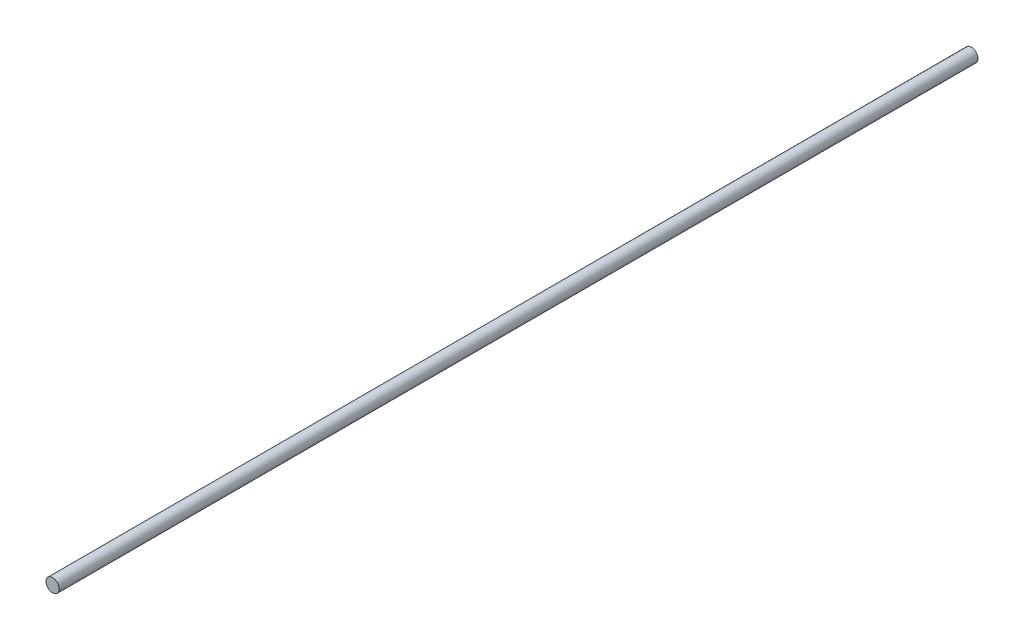
ISO-10303-21;
HEADER;
FILE_DESCRIPTION(('STEP AP214'),'2;1');
FILE_NAME('part.step','',(''),(''),'','','');
FILE_SCHEMA(('AUTOMOTIVE_DESIGN { 1 0 10303 214 1 1 1 1 }'));
ENDSEC;
DATA;
#1=APPLICATION_CONTEXT('core data for automotive mechanical design processes');
#2=APPLICATION_PROTOCOL_DEFINITION('international standard','automotive_design',2000,#1);
#3=PRODUCT_CONTEXT('',#1,'mechanical');
#4=PRODUCT('Part','Part','',(#3));
#5=PRODUCT_RELATED_PRODUCT_CATEGORY('part','',(#4));
#6=PRODUCT_DEFINITION_FORMATION('','',#4);
#7=PRODUCT_DEFINITION_CONTEXT('part definition',#1,'design');
#8=PRODUCT_DEFINITION('design','',#6,#7);
#9=PRODUCT_DEFINITION_SHAPE('','',#8);
#10=(LENGTH_UNIT() NAMED_UNIT(*) SI_UNIT(.MILLI.,.METRE.));
#11=(NAMED_UNIT(*) PLANE_ANGLE_UNIT() SI_UNIT($,.RADIAN.));
#12=(NAMED_UNIT(*) SI_UNIT($,.STERADIAN.) SOLID_ANGLE_UNIT());
#13=UNCERTAINTY_MEASURE_WITH_UNIT(LENGTH_MEASURE(1.E-05),#10,'distance_accuracy_value','');
#14=(GEOMETRIC_REPRESENTATION_CONTEXT(3) GLOBAL_UNCERTAINTY_ASSIGNED_CONTEXT((#13)) GLOBAL_UNIT_ASSIGNED_CONTEXT((#10,
#11,#12)) REPRESENTATION_CONTEXT('',''));
#15=CARTESIAN_POINT('',(0.,0.,0.));
#16=DIRECTION('',(0.,0.,1.));
#17=DIRECTION('',(1.,0.,0.));
#18=AXIS2_PLACEMENT_3D('',#15,#16,#17);
#19=CARTESIAN_POINT('',(0.,0.,-555.));
#20=DIRECTION('',(0.,0.,1.));
#21=DIRECTION('',(1.,0.,0.));
#22=AXIS2_PLACEMENT_3D('',#19,#20,#21);
#23=CYLINDRICAL_SURFACE('',#22,4.);
#24=CARTESIAN_POINT('',(0.,0.,-555.));
#25=DIRECTION('',(0.,0.,1.));
#26=DIRECTION('',(1.,0.,0.));
#27=AXIS2_PLACEMENT_3D('',#24,#25,#26);
#28=CIRCLE('',#27,4.);
#29=CARTESIAN_POINT('',(4.,0.,-555.));
#30=VERTEX_POINT('',#29);
#31=EDGE_CURVE('E10',#30,#30,#28,.T.);
#32=ORIENTED_EDGE('',*,*,#31,.T.);
#33=EDGE_LOOP('',(#32));
#34=FACE_BOUND('',#33,.T.);
#35=CARTESIAN_POINT('',(0.,0.,0.));
#36=DIRECTION('',(0.,0.,1.));
#37=DIRECTION('',(1.,0.,0.));
#38=AXIS2_PLACEMENT_3D('',#35,#36,#37);
#39=CIRCLE('',#38,4.);
#40=CARTESIAN_POINT('',(4.,0.,0.));
#41=VERTEX_POINT('',#40);
#42=EDGE_CURVE('E44',#41,#41,#39,.T.);
#43=ORIENTED_EDGE('',*,*,#42,.F.);
#44=EDGE_LOOP('',(#43));
#45=FACE_BOUND('',#44,.T.);
#46=ADVANCED_FACE('F41',(#34,#45),#23,.T.);
#47=CARTESIAN_POINT('',(0.,0.,-555.));
#48=DIRECTION('',(0.,0.,1.));
#49=DIRECTION('',(1.,0.,0.));
#50=AXIS2_PLACEMENT_3D('',#47,#48,#49);
#51=PLANE('',#50);
#52=ORIENTED_EDGE('',*,*,#31,.F.);
#53=EDGE_LOOP('',(#52));
#54=FACE_BOUND('',#53,.T.);
#55=ADVANCED_FACE('F56',(#54),#51,.F.);
#56=CARTESIAN_POINT('',(0.,0.,0.));
#57=DIRECTION('',(0.,0.,1.));
#58=DIRECTION('',(1.,0.,0.));
#59=AXIS2_PLACEMENT_3D('',#56,#57,#58);
#60=PLANE('',#59);
#61=ORIENTED_EDGE('',*,*,#42,.T.);
#62=EDGE_LOOP('',(#61));
#63=FACE_BOUND('',#62,.T.);
#64=ADVANCED_FACE('F53',(#63),#60,.T.);
#65=CLOSED_SHELL('',(#46,#55,#64));
#66=MANIFOLD_SOLID_BREP('B2',#65);
#67=ADVANCED_BREP_SHAPE_REPRESENTATION('',(#18,#66),#14);
#68=SHAPE_DEFINITION_REPRESENTATION(#9,#67);
ENDSEC;
END-ISO-10303-21;
